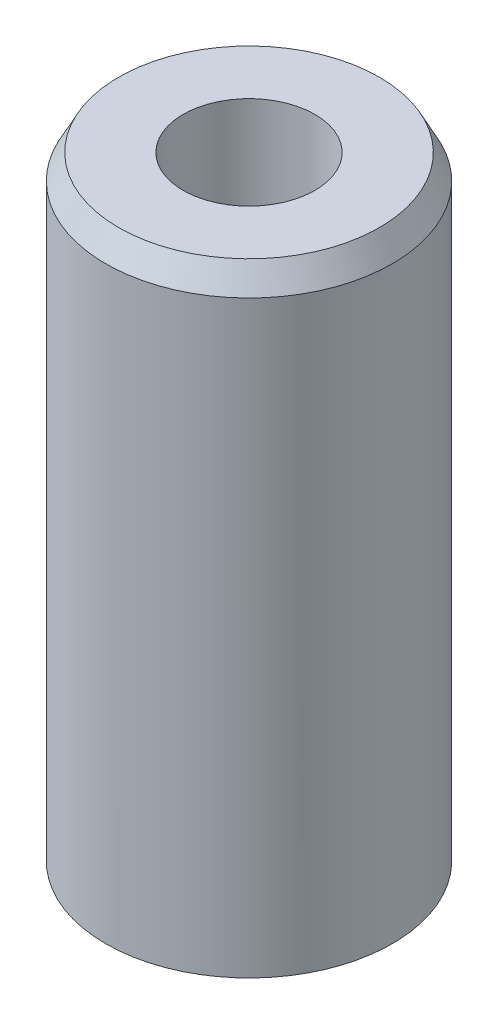
ISO-10303-21;
HEADER;
FILE_DESCRIPTION(('STEP AP214'),'2;1');
FILE_NAME('part.step','',(''),(''),'','','');
FILE_SCHEMA(('AUTOMOTIVE_DESIGN { 1 0 10303 214 1 1 1 1 }'));
ENDSEC;
DATA;
#1=APPLICATION_CONTEXT('core data for automotive mechanical design processes');
#2=APPLICATION_PROTOCOL_DEFINITION('international standard','automotive_design',2000,#1);
#3=PRODUCT_CONTEXT('',#1,'mechanical');
#4=PRODUCT('Part','Part','',(#3));
#5=PRODUCT_RELATED_PRODUCT_CATEGORY('part','',(#4));
#6=PRODUCT_DEFINITION_FORMATION('','',#4);
#7=PRODUCT_DEFINITION_CONTEXT('part definition',#1,'design');
#8=PRODUCT_DEFINITION('design','',#6,#7);
#9=PRODUCT_DEFINITION_SHAPE('','',#8);
#10=(LENGTH_UNIT() NAMED_UNIT(*) SI_UNIT(.MILLI.,.METRE.));
#11=(NAMED_UNIT(*) PLANE_ANGLE_UNIT() SI_UNIT($,.RADIAN.));
#12=(NAMED_UNIT(*) SI_UNIT($,.STERADIAN.) SOLID_ANGLE_UNIT());
#13=UNCERTAINTY_MEASURE_WITH_UNIT(LENGTH_MEASURE(1.E-05),#10,'distance_accuracy_value','');
#14=(GEOMETRIC_REPRESENTATION_CONTEXT(3) GLOBAL_UNCERTAINTY_ASSIGNED_CONTEXT((#13)) GLOBAL_UNIT_ASSIGNED_CONTEXT((#10,
#11,#12)) REPRESENTATION_CONTEXT('',''));
#15=CARTESIAN_POINT('',(0.,0.,0.));
#16=DIRECTION('',(0.,0.,1.));
#17=DIRECTION('',(1.,0.,0.));
#18=AXIS2_PLACEMENT_3D('',#15,#16,#17);
#19=CARTESIAN_POINT('',(0.,120.22552974324,0.));
#20=DIRECTION('',(0.,-1.,0.));
#21=DIRECTION('',(0.,0.,-1.));
#22=AXIS2_PLACEMENT_3D('',#19,#20,#21);
#23=CYLINDRICAL_SURFACE('',#22,27.5);
#24=CARTESIAN_POINT('',(0.,115.470454440618,0.));
#25=DIRECTION('',(0.,1.,0.));
#26=DIRECTION('',(0.,0.,1.));
#27=AXIS2_PLACEMENT_3D('',#24,#25,#26);
#28=CIRCLE('',#27,27.5);
#29=CARTESIAN_POINT('',(0.,115.470454440618,-27.5));
#30=VERTEX_POINT('',#29);
#31=EDGE_CURVE('E50',#30,#30,#28,.F.);
#32=CARTESIAN_POINT('',(0.,2.49483619448802,0.));
#33=DIRECTION('',(0.,1.,0.));
#34=DIRECTION('',(0.,0.,1.));
#35=AXIS2_PLACEMENT_3D('',#32,#33,#34);
#36=CIRCLE('',#35,27.5);
#37=CARTESIAN_POINT('',(0.,2.49483619448802,-27.5));
#38=VERTEX_POINT('',#37);
#39=EDGE_CURVE('E51',#38,#38,#36,.T.);
#40=CARTESIAN_POINT('',(0.,115.470454440618,-27.5));
#41=CARTESIAN_POINT('',(0.,114.293625083888,-27.5));
#42=CARTESIAN_POINT('',(0.,113.116795727157,-27.5));
#43=CARTESIAN_POINT('',(0.,110.763137013696,-27.5));
#44=CARTESIAN_POINT('',(0.,109.586307656965,-27.5));
#45=CARTESIAN_POINT('',(0.,107.232648943504,-27.5));
#46=CARTESIAN_POINT('',(0.,106.055819586774,-27.5));
#47=CARTESIAN_POINT('',(0.,103.702160873313,-27.5));
#48=CARTESIAN_POINT('',(0.,102.525331516582,-27.5));
#49=CARTESIAN_POINT('',(0.,100.171672803121,-27.5));
#50=CARTESIAN_POINT('',(0.,98.9948434463908,-27.5));
#51=CARTESIAN_POINT('',(0.,96.6411847329297,-27.5));
#52=CARTESIAN_POINT('',(0.,95.4643553761992,-27.5));
#53=CARTESIAN_POINT('',(0.,93.1106966627382,-27.5));
#54=CARTESIAN_POINT('',(0.,91.9338673060077,-27.5));
#55=CARTESIAN_POINT('',(0.,89.5802085925466,-27.5));
#56=CARTESIAN_POINT('',(0.,88.4033792358161,-27.5));
#57=CARTESIAN_POINT('',(0.,86.0497205223551,-27.5));
#58=CARTESIAN_POINT('',(0.,84.8728911656245,-27.5));
#59=CARTESIAN_POINT('',(0.,82.5192324521635,-27.5));
#60=CARTESIAN_POINT('',(0.,81.342403095433,-27.5));
#61=CARTESIAN_POINT('',(0.,78.9887443819719,-27.5));
#62=CARTESIAN_POINT('',(0.,77.8119150252414,-27.5));
#63=CARTESIAN_POINT('',(0.,75.4582563117803,-27.5));
#64=CARTESIAN_POINT('',(0.,74.2814269550498,-27.5));
#65=CARTESIAN_POINT('',(0.,71.9277682415888,-27.5));
#66=CARTESIAN_POINT('',(0.,70.7509388848583,-27.5));
#67=CARTESIAN_POINT('',(0.,68.3972801713972,-27.5));
#68=CARTESIAN_POINT('',(0.,67.2204508146667,-27.5));
#69=CARTESIAN_POINT('',(0.,64.8667921012057,-27.5));
#70=CARTESIAN_POINT('',(0.,63.6899627444752,-27.5));
#71=CARTESIAN_POINT('',(0.,61.3363040310141,-27.5));
#72=CARTESIAN_POINT('',(0.,60.1594746742836,-27.5));
#73=CARTESIAN_POINT('',(0.,57.8058159608225,-27.5));
#74=CARTESIAN_POINT('',(0.,56.628986604092,-27.5));
#75=CARTESIAN_POINT('',(0.,54.275327890631,-27.5));
#76=CARTESIAN_POINT('',(0.,53.0984985339005,-27.5));
#77=CARTESIAN_POINT('',(0.,50.7448398204394,-27.5));
#78=CARTESIAN_POINT('',(0.,49.5680104637089,-27.5));
#79=CARTESIAN_POINT('',(0.,47.2143517502478,-27.5));
#80=CARTESIAN_POINT('',(0.,46.0375223935173,-27.5));
#81=CARTESIAN_POINT('',(0.,43.6838636800563,-27.5));
#82=CARTESIAN_POINT('',(0.,42.5070343233258,-27.5));
#83=CARTESIAN_POINT('',(0.,40.1533756098647,-27.5));
#84=CARTESIAN_POINT('',(0.,38.9765462531342,-27.5));
#85=CARTESIAN_POINT('',(0.,36.6228875396732,-27.5));
#86=CARTESIAN_POINT('',(0.,35.4460581829426,-27.5));
#87=CARTESIAN_POINT('',(0.,33.0923994694816,-27.5));
#88=CARTESIAN_POINT('',(0.,31.9155701127511,-27.5));
#89=CARTESIAN_POINT('',(0.,29.56191139929,-27.5));
#90=CARTESIAN_POINT('',(0.,28.3850820425595,-27.5));
#91=CARTESIAN_POINT('',(0.,26.0314233290985,-27.5));
#92=CARTESIAN_POINT('',(0.,24.8545939723679,-27.5));
#93=CARTESIAN_POINT('',(0.,22.5009352589069,-27.5));
#94=CARTESIAN_POINT('',(0.,21.3241059021764,-27.5));
#95=CARTESIAN_POINT('',(0.,18.9704471887153,-27.5));
#96=CARTESIAN_POINT('',(0.,17.7936178319848,-27.5));
#97=CARTESIAN_POINT('',(0.,15.4399591185238,-27.5));
#98=CARTESIAN_POINT('',(0.,14.2631297617932,-27.5));
#99=CARTESIAN_POINT('',(0.,11.9094710483322,-27.5));
#100=CARTESIAN_POINT('',(0.,10.7326416916017,-27.5));
#101=CARTESIAN_POINT('',(0.,8.37898297814063,-27.5));
#102=CARTESIAN_POINT('',(0.,7.20215362141011,-27.5));
#103=CARTESIAN_POINT('',(0.,4.84849490794906,-27.5));
#104=CARTESIAN_POINT('',(0.,3.67166555121854,-27.5));
#105=CARTESIAN_POINT('',(0.,2.49483619448802,-27.5));
#106=B_SPLINE_CURVE_WITH_KNOTS('',3,(#40,#41,#42,#43,#44,#45,#46,#47,#48,#49,#50,#51,#52,#53,
#54,#55,#56,#57,#58,#59,#60,#61,#62,#63,#64,#65,#66,#67,#68,#69,#70,#71,#72,#73,#74,#75,#76,#77,
#78,#79,#80,#81,#82,#83,#84,#85,#86,#87,#88,#89,#90,#91,#92,#93,#94,#95,#96,#97,#98,#99,#100,
#101,#102,#103,#104,#105),.UNSPECIFIED.,.F.,.F.,(4,2,2,2,2,2,2,2,2,2,2,2,2,2,2,2,2,2,2,2,2,2,2,
2,2,2,2,2,2,2,2,2,4),(0.,3.53048807019156,7.06097614038312,10.5914642105747,14.1219522807663,
17.6524403509578,21.1829284211494,24.7134164913409,28.2439045615325,31.7743926317241,
35.3048807019156,38.8353687721072,42.3658568422988,45.8963449124903,49.4268329826819,
52.9573210528735,56.487809123065,60.0182971932566,63.5487852634481,67.0792733336397,
70.6097614038313,74.1402494740229,77.6707375442144,81.201225614406,84.7317136845976,
88.2622017547891,91.7926898249807,95.3231778951722,98.8536659653638,102.384154035555,
105.914642105747,109.445130175939,112.97561824613),.UNSPECIFIED.);
#107=EDGE_CURVE('BSEAM39',#30,#38,#106,.T.);
#108=ORIENTED_EDGE('',*,*,#31,.T.);
#109=ORIENTED_EDGE('',*,*,#39,.T.);
#110=ORIENTED_EDGE('',*,*,#107,.T.);
#111=ORIENTED_EDGE('',*,*,#107,.F.);
#112=EDGE_LOOP('',(#108,#110,#109,#111));
#113=FACE_BOUND('',#112,.T.);
#114=ADVANCED_FACE('F39',(#113),#23,.T.);
#115=CARTESIAN_POINT('',(0.,120.22552974324,0.));
#116=DIRECTION('',(0.,1.,0.));
#117=DIRECTION('',(0.,0.,1.));
#118=AXIS2_PLACEMENT_3D('',#115,#116,#117);
#119=PLANE('',#118);
#120=CARTESIAN_POINT('',(0.,120.22552974324,0.));
#121=DIRECTION('',(0.,1.,0.));
#122=DIRECTION('',(0.,0.,1.));
#123=AXIS2_PLACEMENT_3D('',#120,#121,#122);
#124=CIRCLE('',#123,25.0051638055121);
#125=CARTESIAN_POINT('',(0.,120.22552974324,-25.0051638055121));
#126=VERTEX_POINT('',#125);
#127=EDGE_CURVE('E54',#126,#126,#124,.T.);
#128=ORIENTED_EDGE('',*,*,#127,.T.);
#129=EDGE_LOOP('',(#128));
#130=FACE_BOUND('',#129,.T.);
#131=CARTESIAN_POINT('',(0.,120.22552974324,0.));
#132=DIRECTION('',(0.,1.,0.));
#133=DIRECTION('',(0.,0.,1.));
#134=AXIS2_PLACEMENT_3D('',#131,#132,#133);
#135=CIRCLE('',#134,12.6390165722401);
#136=CARTESIAN_POINT('',(0.,120.22552974324,-12.6390165722401));
#137=VERTEX_POINT('',#136);
#138=EDGE_CURVE('E58',#137,#137,#135,.T.);
#139=ORIENTED_EDGE('',*,*,#138,.F.);
#140=EDGE_LOOP('',(#139));
#141=FACE_BOUND('',#140,.T.);
#142=ADVANCED_FACE('F69',(#130,#141),#119,.T.);
#143=CARTESIAN_POINT('',(0.,0.,0.));
#144=DIRECTION('',(0.,1.,0.));
#145=DIRECTION('',(0.,0.,1.));
#146=AXIS2_PLACEMENT_3D('',#143,#144,#145);
#147=PLANE('',#146);
#148=CARTESIAN_POINT('',(0.,0.,0.));
#149=DIRECTION('',(0.,1.,0.));
#150=DIRECTION('',(0.,0.,1.));
#151=AXIS2_PLACEMENT_3D('',#148,#149,#150);
#152=CIRCLE('',#151,22.7449246973781);
#153=CARTESIAN_POINT('',(0.,0.,22.7449246973781));
#154=VERTEX_POINT('',#153);
#155=EDGE_CURVE('E10',#154,#154,#152,.F.);
#156=ORIENTED_EDGE('',*,*,#155,.T.);
#157=EDGE_LOOP('',(#156));
#158=FACE_BOUND('',#157,.T.);
#159=CARTESIAN_POINT('',(0.,0.,0.));
#160=DIRECTION('',(0.,1.,0.));
#161=DIRECTION('',(0.,0.,1.));
#162=AXIS2_PLACEMENT_3D('',#159,#160,#161);
#163=CIRCLE('',#162,12.6390165722401);
#164=CARTESIAN_POINT('',(0.,0.,-12.6390165722401));
#165=VERTEX_POINT('',#164);
#166=EDGE_CURVE('E63',#165,#165,#163,.T.);
#167=ORIENTED_EDGE('',*,*,#166,.T.);
#168=EDGE_LOOP('',(#167));
#169=FACE_BOUND('',#168,.T.);
#170=ADVANCED_FACE('F75',(#158,#169),#147,.F.);
#171=CARTESIAN_POINT('',(0.,120.22552974324,0.));
#172=DIRECTION('',(0.,-1.,0.));
#173=DIRECTION('',(0.,0.,-1.));
#174=AXIS2_PLACEMENT_3D('',#171,#172,#173);
#175=CYLINDRICAL_SURFACE('',#174,12.6390165722401);
#176=CARTESIAN_POINT('',(0.,120.22552974324,-12.6390165722401));
#177=CARTESIAN_POINT('',(0.,118.973180475081,-12.6390165722401));
#178=CARTESIAN_POINT('',(0.,117.720831206922,-12.6390165722401));
#179=CARTESIAN_POINT('',(0.,115.216132670605,-12.6390165722401));
#180=CARTESIAN_POINT('',(0.,113.963783402446,-12.6390165722401));
#181=CARTESIAN_POINT('',(0.,111.459084866129,-12.6390165722401));
#182=CARTESIAN_POINT('',(0.,110.20673559797,-12.6390165722401));
#183=CARTESIAN_POINT('',(0.,107.702037061652,-12.6390165722401));
#184=CARTESIAN_POINT('',(0.,106.449687793494,-12.6390165722401));
#185=CARTESIAN_POINT('',(0.,103.944989257176,-12.6390165722401));
#186=CARTESIAN_POINT('',(0.,102.692639989017,-12.6390165722401));
#187=CARTESIAN_POINT('',(0.,100.1879414527,-12.6390165722401));
#188=CARTESIAN_POINT('',(0.,98.9355921845411,-12.6390165722401));
#189=CARTESIAN_POINT('',(0.,96.4308936482236,-12.6390165722401));
#190=CARTESIAN_POINT('',(0.,95.1785443800648,-12.6390165722401));
#191=CARTESIAN_POINT('',(0.,92.6738458437473,-12.6390165722401));
#192=CARTESIAN_POINT('',(0.,91.4214965755886,-12.6390165722401));
#193=CARTESIAN_POINT('',(0.,88.9167980392711,-12.6390165722401));
#194=CARTESIAN_POINT('',(0.,87.6644487711123,-12.6390165722401));
#195=CARTESIAN_POINT('',(0.,85.1597502347948,-12.6390165722401));
#196=CARTESIAN_POINT('',(0.,83.9074009666361,-12.6390165722401));
#197=CARTESIAN_POINT('',(0.,81.4027024303186,-12.6390165722401));
#198=CARTESIAN_POINT('',(0.,80.1503531621598,-12.6390165722401));
#199=CARTESIAN_POINT('',(0.,77.6456546258423,-12.6390165722401));
#200=CARTESIAN_POINT('',(0.,76.3933053576836,-12.6390165722401));
#201=CARTESIAN_POINT('',(0.,73.8886068213661,-12.6390165722401));
#202=CARTESIAN_POINT('',(0.,72.6362575532074,-12.6390165722401));
#203=CARTESIAN_POINT('',(0.,70.1315590168899,-12.6390165722401));
#204=CARTESIAN_POINT('',(0.,68.8792097487311,-12.6390165722401));
#205=CARTESIAN_POINT('',(0.,66.3745112124136,-12.6390165722401));
#206=CARTESIAN_POINT('',(0.,65.1221619442549,-12.6390165722401));
#207=CARTESIAN_POINT('',(0.,62.6174634079374,-12.6390165722401));
#208=CARTESIAN_POINT('',(0.,61.3651141397786,-12.6390165722401));
#209=CARTESIAN_POINT('',(0.,58.8604156034611,-12.6390165722401));
#210=CARTESIAN_POINT('',(0.,57.6080663353024,-12.6390165722401));
#211=CARTESIAN_POINT('',(0.,55.1033677989849,-12.6390165722401));
#212=CARTESIAN_POINT('',(0.,53.8510185308261,-12.6390165722401));
#213=CARTESIAN_POINT('',(0.,51.3463199945086,-12.6390165722401));
#214=CARTESIAN_POINT('',(0.,50.0939707263499,-12.6390165722401));
#215=CARTESIAN_POINT('',(0.,47.5892721900324,-12.6390165722401));
#216=CARTESIAN_POINT('',(0.,46.3369229218737,-12.6390165722401));
#217=CARTESIAN_POINT('',(0.,43.8322243855562,-12.6390165722401));
#218=CARTESIAN_POINT('',(0.,42.5798751173974,-12.6390165722401));
#219=CARTESIAN_POINT('',(0.,40.0751765810799,-12.6390165722401));
#220=CARTESIAN_POINT('',(0.,38.8228273129212,-12.6390165722401));
#221=CARTESIAN_POINT('',(0.,36.3181287766037,-12.6390165722401));
#222=CARTESIAN_POINT('',(0.,35.0657795084449,-12.6390165722401));
#223=CARTESIAN_POINT('',(0.,32.5610809721274,-12.6390165722401));
#224=CARTESIAN_POINT('',(0.,31.3087317039687,-12.6390165722401));
#225=CARTESIAN_POINT('',(0.,28.8040331676512,-12.6390165722401));
#226=CARTESIAN_POINT('',(0.,27.5516838994924,-12.6390165722401));
#227=CARTESIAN_POINT('',(0.,25.0469853631749,-12.6390165722401));
#228=CARTESIAN_POINT('',(0.,23.7946360950162,-12.6390165722401));
#229=CARTESIAN_POINT('',(0.,21.2899375586987,-12.6390165722401));
#230=CARTESIAN_POINT('',(0.,20.03758829054,-12.6390165722401));
#231=CARTESIAN_POINT('',(0.,17.5328897542225,-12.6390165722401));
#232=CARTESIAN_POINT('',(0.,16.2805404860637,-12.6390165722401));
#233=CARTESIAN_POINT('',(0.,13.7758419497462,-12.6390165722401));
#234=CARTESIAN_POINT('',(0.,12.5234926815875,-12.6390165722401));
#235=CARTESIAN_POINT('',(0.,10.01879414527,-12.6390165722401));
#236=CARTESIAN_POINT('',(0.,8.76644487711122,-12.6390165722401));
#237=CARTESIAN_POINT('',(0.,6.26174634079373,-12.6390165722401));
#238=CARTESIAN_POINT('',(0.,5.00939707263498,-12.6390165722401));
#239=CARTESIAN_POINT('',(0.,2.50469853631749,-12.6390165722401));
#240=CARTESIAN_POINT('',(0.,1.25234926815874,-12.6390165722401));
#241=CARTESIAN_POINT('',(0.,0.,-12.6390165722401));
#242=B_SPLINE_CURVE_WITH_KNOTS('',3,(#176,#177,#178,#179,#180,#181,#182,#183,#184,#185,#186,
#187,#188,#189,#190,#191,#192,#193,#194,#195,#196,#197,#198,#199,#200,#201,#202,#203,#204,#205,
#206,#207,#208,#209,#210,#211,#212,#213,#214,#215,#216,#217,#218,#219,#220,#221,#222,#223,#224,
#225,#226,#227,#228,#229,#230,#231,#232,#233,#234,#235,#236,#237,#238,#239,#240,#241),
.UNSPECIFIED.,.F.,.F.,(4,2,2,2,2,2,2,2,2,2,2,2,2,2,2,2,2,2,2,2,2,2,2,2,2,2,2,2,2,2,2,2,4),(0.,
3.75704780447623,7.51409560895248,11.2711434134287,15.028191217905,18.7852390223812,
22.5422868268575,26.2993346313337,30.0563824358099,33.8134302402862,37.5704780447624,
41.3275258492387,45.0845736537149,48.8416214581911,52.5986692626674,56.3557170671436,
60.1127648716199,63.8698126760961,67.6268604805724,71.3839082850486,75.1409560895248,
78.8980038940011,82.6550516984773,86.4120995029536,90.1691473074298,93.9261951119061,
97.6832429163823,101.440290720859,105.197338525335,108.954386329811,112.711434134287,
116.468481938764,120.22552974324),.UNSPECIFIED.);
#243=EDGE_CURVE('BSEAM70',#137,#165,#242,.T.);
#244=ORIENTED_EDGE('',*,*,#138,.T.);
#245=ORIENTED_EDGE('',*,*,#166,.F.);
#246=ORIENTED_EDGE('',*,*,#243,.T.);
#247=ORIENTED_EDGE('',*,*,#243,.F.);
#248=EDGE_LOOP('',(#244,#246,#245,#247));
#249=FACE_BOUND('',#248,.T.);
#250=ADVANCED_FACE('F70',(#249),#175,.F.);
#251=CARTESIAN_POINT('',(0.,120.22552974324,0.));
#252=DIRECTION('',(0.,-1.,0.));
#253=DIRECTION('',(0.,0.,-1.));
#254=AXIS2_PLACEMENT_3D('',#251,#252,#253);
#255=CONICAL_SURFACE('',#254,25.0051638055121,0.483186758423489);
#256=CARTESIAN_POINT('',(0.,115.470454440618,-27.5));
#257=CARTESIAN_POINT('',(0.,115.51998647502,-27.4740121229741));
#258=CARTESIAN_POINT('',(0.,115.569518509423,-27.4480242459482));
#259=CARTESIAN_POINT('',(0.,115.668582578227,-27.3960484918963));
#260=CARTESIAN_POINT('',(0.,115.71811461263,-27.3700606148704));
#261=CARTESIAN_POINT('',(0.,115.817178681434,-27.3180848608186));
#262=CARTESIAN_POINT('',(0.,115.866710715837,-27.2920969837927));
#263=CARTESIAN_POINT('',(0.,115.965774784641,-27.2401212297409));
#264=CARTESIAN_POINT('',(0.,116.015306819044,-27.2141333527149));
#265=CARTESIAN_POINT('',(0.,116.114370887848,-27.1621575986631));
#266=CARTESIAN_POINT('',(0.,116.16390292225,-27.1361697216372));
#267=CARTESIAN_POINT('',(0.,116.262966991055,-27.0841939675854));
#268=CARTESIAN_POINT('',(0.,116.312499025457,-27.0582060905594));
#269=CARTESIAN_POINT('',(0.,116.411563094262,-27.0062303365076));
#270=CARTESIAN_POINT('',(0.,116.461095128664,-26.9802424594817));
#271=CARTESIAN_POINT('',(0.,116.560159197469,-26.9282667054299));
#272=CARTESIAN_POINT('',(0.,116.609691231871,-26.9022788284039));
#273=CARTESIAN_POINT('',(0.,116.708755300676,-26.8503030743521));
#274=CARTESIAN_POINT('',(0.,116.758287335078,-26.8243151973262));
#275=CARTESIAN_POINT('',(0.,116.857351403883,-26.7723394432744));
#276=CARTESIAN_POINT('',(0.,116.906883438285,-26.7463515662485));
#277=CARTESIAN_POINT('',(0.,117.00594750709,-26.6943758121966));
#278=CARTESIAN_POINT('',(0.,117.055479541492,-26.6683879351707));
#279=CARTESIAN_POINT('',(0.,117.154543610297,-26.6164121811189));
#280=CARTESIAN_POINT('',(0.,117.204075644699,-26.590424304093));
#281=CARTESIAN_POINT('',(0.,117.303139713504,-26.5384485500411));
#282=CARTESIAN_POINT('',(0.,117.352671747906,-26.5124606730152));
#283=CARTESIAN_POINT('',(0.,117.45173581671,-26.4604849189634));
#284=CARTESIAN_POINT('',(0.,117.501267851113,-26.4344970419375));
#285=CARTESIAN_POINT('',(0.,117.600331919917,-26.3825212878856));
#286=CARTESIAN_POINT('',(0.,117.64986395432,-26.3565334108597));
#287=CARTESIAN_POINT('',(0.,117.748928023124,-26.3045576568079));
#288=CARTESIAN_POINT('',(0.,117.798460057527,-26.278569779782));
#289=CARTESIAN_POINT('',(0.,117.897524126331,-26.2265940257301));
#290=CARTESIAN_POINT('',(0.,117.947056160734,-26.2006061487042));
#291=CARTESIAN_POINT('',(0.,118.046120229538,-26.1486303946524));
#292=CARTESIAN_POINT('',(0.,118.09565226394,-26.1226425176265));
#293=CARTESIAN_POINT('',(0.,118.194716332745,-26.0706667635746));
#294=CARTESIAN_POINT('',(0.,118.244248367147,-26.0446788865487));
#295=CARTESIAN_POINT('',(0.,118.343312435952,-25.9927031324969));
#296=CARTESIAN_POINT('',(0.,118.392844470354,-25.966715255471));
#297=CARTESIAN_POINT('',(0.,118.491908539159,-25.9147395014191));
#298=CARTESIAN_POINT('',(0.,118.541440573561,-25.8887516243932));
#299=CARTESIAN_POINT('',(0.,118.640504642366,-25.8367758703414));
#300=CARTESIAN_POINT('',(0.,118.690036676768,-25.8107879933155));
#301=CARTESIAN_POINT('',(0.,118.789100745573,-25.7588122392637));
#302=CARTESIAN_POINT('',(0.,118.838632779975,-25.7328243622377));
#303=CARTESIAN_POINT('',(0.,118.93769684878,-25.6808486081859));
#304=CARTESIAN_POINT('',(0.,118.987228883182,-25.65486073116));
#305=CARTESIAN_POINT('',(0.,119.086292951987,-25.6028849771082));
#306=CARTESIAN_POINT('',(0.,119.135824986389,-25.5768971000822));
#307=CARTESIAN_POINT('',(0.,119.234889055194,-25.5249213460304));
#308=CARTESIAN_POINT('',(0.,119.284421089596,-25.4989334690045));
#309=CARTESIAN_POINT('',(0.,119.383485158401,-25.4469577149527));
#310=CARTESIAN_POINT('',(0.,119.433017192803,-25.4209698379268));
#311=CARTESIAN_POINT('',(0.,119.532081261607,-25.3689940838749));
#312=CARTESIAN_POINT('',(0.,119.58161329601,-25.343006206849));
#313=CARTESIAN_POINT('',(0.,119.680677364814,-25.2910304527972));
#314=CARTESIAN_POINT('',(0.,119.730209399217,-25.2650425757713));
#315=CARTESIAN_POINT('',(0.,119.829273468021,-25.2130668217194));
#316=CARTESIAN_POINT('',(0.,119.878805502424,-25.1870789446935));
#317=CARTESIAN_POINT('',(0.,119.977869571228,-25.1351031906417));
#318=CARTESIAN_POINT('',(0.,120.027401605631,-25.1091153136158));
#319=CARTESIAN_POINT('',(0.,120.126465674435,-25.0571395595639));
#320=CARTESIAN_POINT('',(0.,120.175997708837,-25.031151682538));
#321=CARTESIAN_POINT('',(0.,120.22552974324,-25.0051638055121));
#322=B_SPLINE_CURVE_WITH_KNOTS('',3,(#256,#257,#258,#259,#260,#261,#262,#263,#264,#265,#266,
#267,#268,#269,#270,#271,#272,#273,#274,#275,#276,#277,#278,#279,#280,#281,#282,#283,#284,#285,
#286,#287,#288,#289,#290,#291,#292,#293,#294,#295,#296,#297,#298,#299,#300,#301,#302,#303,#304,
#305,#306,#307,#308,#309,#310,#311,#312,#313,#314,#315,#316,#317,#318,#319,#320,#321),
.UNSPECIFIED.,.F.,.F.,(4,2,2,2,2,2,2,2,2,2,2,2,2,2,2,2,2,2,2,2,2,2,2,2,2,2,2,2,2,2,2,2,4),(0.,
0.167806822445071,0.335613644890141,0.503420467335213,0.671227289780284,0.839034112225354,
1.00684093467041,1.17464775711548,1.34245457956056,1.51026140200563,1.6780682244507,
1.84587504689576,2.01368186934083,2.1814886917859,2.34929551423097,2.51710233667604,
2.6849091591211,2.85271598156617,3.02052280401124,3.18832962645631,3.35613644890139,
3.52394327134646,3.69175009379151,3.85955691623659,4.02736373868166,4.19517056112673,
4.3629773835718,4.53078420601686,4.69859102846193,4.866397850907,5.03420467335207,
5.20201149579715,5.36981831824222),.UNSPECIFIED.);
#323=EDGE_CURVE('BSEAM81',#30,#126,#322,.T.);
#324=ORIENTED_EDGE('',*,*,#31,.F.);
#325=ORIENTED_EDGE('',*,*,#127,.F.);
#326=ORIENTED_EDGE('',*,*,#323,.T.);
#327=ORIENTED_EDGE('',*,*,#323,.F.);
#328=EDGE_LOOP('',(#324,#326,#325,#327));
#329=FACE_BOUND('',#328,.T.);
#330=ADVANCED_FACE('F81',(#329),#255,.T.);
#331=CARTESIAN_POINT('',(0.,2.49483619448802,0.));
#332=DIRECTION('',(0.,1.,0.));
#333=DIRECTION('',(0.,0.,1.));
#334=AXIS2_PLACEMENT_3D('',#331,#332,#333);
#335=CONICAL_SURFACE('',#334,27.5,1.08760956837141);
#336=ORIENTED_EDGE('',*,*,#155,.F.);
#337=EDGE_LOOP('',(#336));
#338=FACE_BOUND('',#337,.T.);
#339=ORIENTED_EDGE('',*,*,#39,.F.);
#340=EDGE_LOOP('',(#339));
#341=FACE_BOUND('',#340,.T.);
#342=ADVANCED_FACE('F45',(#338,#341),#335,.T.);
#343=CLOSED_SHELL('',(#114,#142,#170,#250,#330,#342));
#344=MANIFOLD_SOLID_BREP('B2',#343);
#345=ADVANCED_BREP_SHAPE_REPRESENTATION('',(#18,#344),#14);
#346=SHAPE_DEFINITION_REPRESENTATION(#9,#345);
ENDSEC;
END-ISO-10303-21;
